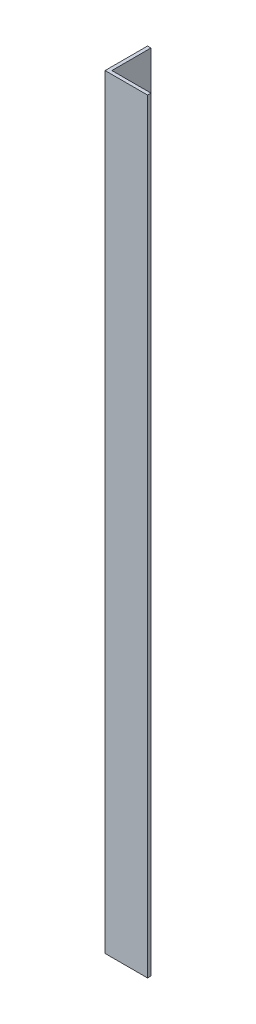
ISO-10303-21;
HEADER;
FILE_DESCRIPTION(('STEP AP214'),'2;1');
FILE_NAME('part.step','',(''),(''),'','','');
FILE_SCHEMA(('AUTOMOTIVE_DESIGN { 1 0 10303 214 1 1 1 1 }'));
ENDSEC;
DATA;
#1=APPLICATION_CONTEXT('core data for automotive mechanical design processes');
#2=APPLICATION_PROTOCOL_DEFINITION('international standard','automotive_design',2000,#1);
#3=PRODUCT_CONTEXT('',#1,'mechanical');
#4=PRODUCT('Part','Part','',(#3));
#5=PRODUCT_RELATED_PRODUCT_CATEGORY('part','',(#4));
#6=PRODUCT_DEFINITION_FORMATION('','',#4);
#7=PRODUCT_DEFINITION_CONTEXT('part definition',#1,'design');
#8=PRODUCT_DEFINITION('design','',#6,#7);
#9=PRODUCT_DEFINITION_SHAPE('','',#8);
#10=(LENGTH_UNIT() NAMED_UNIT(*) SI_UNIT(.MILLI.,.METRE.));
#11=(NAMED_UNIT(*) PLANE_ANGLE_UNIT() SI_UNIT($,.RADIAN.));
#12=(NAMED_UNIT(*) SI_UNIT($,.STERADIAN.) SOLID_ANGLE_UNIT());
#13=UNCERTAINTY_MEASURE_WITH_UNIT(LENGTH_MEASURE(1.E-05),#10,'distance_accuracy_value','');
#14=(GEOMETRIC_REPRESENTATION_CONTEXT(3) GLOBAL_UNCERTAINTY_ASSIGNED_CONTEXT((#13)) GLOBAL_UNIT_ASSIGNED_CONTEXT((#10,
#11,#12)) REPRESENTATION_CONTEXT('',''));
#15=CARTESIAN_POINT('',(0.,0.,0.));
#16=DIRECTION('',(0.,0.,1.));
#17=DIRECTION('',(1.,0.,0.));
#18=AXIS2_PLACEMENT_3D('',#15,#16,#17);
#19=CARTESIAN_POINT('',(0.,900.,0.));
#20=DIRECTION('',(0.,0.,-1.));
#21=DIRECTION('',(-1.,0.,0.));
#22=AXIS2_PLACEMENT_3D('',#19,#20,#21);
#23=PLANE('',#22);
#24=DIRECTION('',(1.,0.,0.));
#25=VECTOR('',#24,1.);
#26=CARTESIAN_POINT('',(0.,0.,0.));
#27=LINE('',#26,#25);
#28=CARTESIAN_POINT('',(0.,0.,0.));
#29=VERTEX_POINT('',#28);
#30=CARTESIAN_POINT('',(50.,0.,0.));
#31=VERTEX_POINT('',#30);
#32=EDGE_CURVE('E118',#29,#31,#27,.T.);
#33=ORIENTED_EDGE('',*,*,#32,.T.);
#34=DIRECTION('',(0.,-1.,0.));
#35=VECTOR('',#34,1.);
#36=CARTESIAN_POINT('',(50.,900.,0.));
#37=LINE('',#36,#35);
#38=CARTESIAN_POINT('',(50.,900.,0.));
#39=VERTEX_POINT('',#38);
#40=EDGE_CURVE('E11',#39,#31,#37,.T.);
#41=ORIENTED_EDGE('',*,*,#40,.F.);
#42=DIRECTION('',(1.,0.,0.));
#43=VECTOR('',#42,1.);
#44=CARTESIAN_POINT('',(0.,900.,0.));
#45=LINE('',#44,#43);
#46=CARTESIAN_POINT('',(0.,900.,0.));
#47=VERTEX_POINT('',#46);
#48=EDGE_CURVE('E83',#47,#39,#45,.T.);
#49=ORIENTED_EDGE('',*,*,#48,.F.);
#50=DIRECTION('',(0.,-1.,0.));
#51=VECTOR('',#50,1.);
#52=CARTESIAN_POINT('',(0.,900.,0.));
#53=LINE('',#52,#51);
#54=EDGE_CURVE('E114',#47,#29,#53,.T.);
#55=ORIENTED_EDGE('',*,*,#54,.T.);
#56=EDGE_LOOP('',(#33,#41,#49,#55));
#57=FACE_BOUND('',#56,.T.);
#58=ADVANCED_FACE('F37',(#57),#23,.F.);
#59=CARTESIAN_POINT('',(50.,900.,-4.));
#60=DIRECTION('',(1.,0.,0.));
#61=DIRECTION('',(0.,0.,-1.));
#62=AXIS2_PLACEMENT_3D('',#59,#60,#61);
#63=PLANE('',#62);
#64=DIRECTION('',(0.,0.,1.));
#65=VECTOR('',#64,1.);
#66=CARTESIAN_POINT('',(50.,0.,-4.));
#67=LINE('',#66,#65);
#68=CARTESIAN_POINT('',(50.,0.,-4.));
#69=VERTEX_POINT('',#68);
#70=EDGE_CURVE('E121',#69,#31,#67,.T.);
#71=ORIENTED_EDGE('',*,*,#70,.F.);
#72=DIRECTION('',(0.,-1.,0.));
#73=VECTOR('',#72,1.);
#74=CARTESIAN_POINT('',(50.,900.,-4.));
#75=LINE('',#74,#73);
#76=CARTESIAN_POINT('',(50.,900.,-4.));
#77=VERTEX_POINT('',#76);
#78=EDGE_CURVE('E45',#77,#69,#75,.T.);
#79=ORIENTED_EDGE('',*,*,#78,.F.);
#80=DIRECTION('',(0.,0.,1.));
#81=VECTOR('',#80,1.);
#82=CARTESIAN_POINT('',(50.,900.,-4.));
#83=LINE('',#82,#81);
#84=EDGE_CURVE('E223',#77,#39,#83,.T.);
#85=ORIENTED_EDGE('',*,*,#84,.T.);
#86=ORIENTED_EDGE('',*,*,#40,.T.);
#87=EDGE_LOOP('',(#71,#79,#85,#86));
#88=FACE_BOUND('',#87,.T.);
#89=ADVANCED_FACE('F139',(#88),#63,.T.);
#90=CARTESIAN_POINT('',(0.,900.,-4.));
#91=DIRECTION('',(0.,0.,-1.));
#92=DIRECTION('',(-1.,0.,0.));
#93=AXIS2_PLACEMENT_3D('',#90,#91,#92);
#94=PLANE('',#93);
#95=DIRECTION('',(1.,0.,0.));
#96=VECTOR('',#95,1.);
#97=CARTESIAN_POINT('',(0.,0.,-4.));
#98=LINE('',#97,#96);
#99=CARTESIAN_POINT('',(4.,0.,-4.));
#100=VERTEX_POINT('',#99);
#101=EDGE_CURVE('E124',#100,#69,#98,.T.);
#102=ORIENTED_EDGE('',*,*,#101,.F.);
#103=DIRECTION('',(0.,-1.,0.));
#104=VECTOR('',#103,1.);
#105=CARTESIAN_POINT('',(4.,900.,-4.));
#106=LINE('',#105,#104);
#107=CARTESIAN_POINT('',(4.,900.,-4.));
#108=VERTEX_POINT('',#107);
#109=EDGE_CURVE('E104',#108,#100,#106,.T.);
#110=ORIENTED_EDGE('',*,*,#109,.F.);
#111=DIRECTION('',(1.,0.,0.));
#112=VECTOR('',#111,1.);
#113=CARTESIAN_POINT('',(0.,900.,-4.));
#114=LINE('',#113,#112);
#115=EDGE_CURVE('E110',#108,#77,#114,.T.);
#116=ORIENTED_EDGE('',*,*,#115,.T.);
#117=ORIENTED_EDGE('',*,*,#78,.T.);
#118=EDGE_LOOP('',(#102,#110,#116,#117));
#119=FACE_BOUND('',#118,.T.);
#120=ADVANCED_FACE('F136',(#119),#94,.T.);
#121=CARTESIAN_POINT('',(4.,900.,-50.));
#122=DIRECTION('',(1.,0.,0.));
#123=DIRECTION('',(0.,0.,-1.));
#124=AXIS2_PLACEMENT_3D('',#121,#122,#123);
#125=PLANE('',#124);
#126=DIRECTION('',(0.,0.,1.));
#127=VECTOR('',#126,1.);
#128=CARTESIAN_POINT('',(4.,0.,-50.));
#129=LINE('',#128,#127);
#130=CARTESIAN_POINT('',(4.,0.,-50.));
#131=VERTEX_POINT('',#130);
#132=EDGE_CURVE('E99',#131,#100,#129,.T.);
#133=ORIENTED_EDGE('',*,*,#132,.F.);
#134=DIRECTION('',(0.,-1.,0.));
#135=VECTOR('',#134,1.);
#136=CARTESIAN_POINT('',(4.,900.,-50.));
#137=LINE('',#136,#135);
#138=CARTESIAN_POINT('',(4.,900.,-50.));
#139=VERTEX_POINT('',#138);
#140=EDGE_CURVE('E94',#139,#131,#137,.T.);
#141=ORIENTED_EDGE('',*,*,#140,.F.);
#142=DIRECTION('',(0.,0.,1.));
#143=VECTOR('',#142,1.);
#144=CARTESIAN_POINT('',(4.,900.,-50.));
#145=LINE('',#144,#143);
#146=EDGE_CURVE('E97',#139,#108,#145,.T.);
#147=ORIENTED_EDGE('',*,*,#146,.T.);
#148=ORIENTED_EDGE('',*,*,#109,.T.);
#149=EDGE_LOOP('',(#133,#141,#147,#148));
#150=FACE_BOUND('',#149,.T.);
#151=ADVANCED_FACE('F96',(#150),#125,.T.);
#152=CARTESIAN_POINT('',(0.,900.,-50.));
#153=DIRECTION('',(0.,0.,-1.));
#154=DIRECTION('',(-1.,0.,0.));
#155=AXIS2_PLACEMENT_3D('',#152,#153,#154);
#156=PLANE('',#155);
#157=DIRECTION('',(1.,0.,0.));
#158=VECTOR('',#157,1.);
#159=CARTESIAN_POINT('',(0.,0.,-50.));
#160=LINE('',#159,#158);
#161=CARTESIAN_POINT('',(0.,0.,-50.));
#162=VERTEX_POINT('',#161);
#163=EDGE_CURVE('E128',#162,#131,#160,.T.);
#164=ORIENTED_EDGE('',*,*,#163,.F.);
#165=DIRECTION('',(0.,-1.,0.));
#166=VECTOR('',#165,1.);
#167=CARTESIAN_POINT('',(0.,900.,-50.));
#168=LINE('',#167,#166);
#169=CARTESIAN_POINT('',(0.,900.,-50.));
#170=VERTEX_POINT('',#169);
#171=EDGE_CURVE('E74',#170,#162,#168,.T.);
#172=ORIENTED_EDGE('',*,*,#171,.F.);
#173=DIRECTION('',(1.,0.,0.));
#174=VECTOR('',#173,1.);
#175=CARTESIAN_POINT('',(0.,900.,-50.));
#176=LINE('',#175,#174);
#177=EDGE_CURVE('E108',#170,#139,#176,.T.);
#178=ORIENTED_EDGE('',*,*,#177,.T.);
#179=ORIENTED_EDGE('',*,*,#140,.T.);
#180=EDGE_LOOP('',(#164,#172,#178,#179));
#181=FACE_BOUND('',#180,.T.);
#182=ADVANCED_FACE('F112',(#181),#156,.T.);
#183=CARTESIAN_POINT('',(0.,900.,-50.));
#184=DIRECTION('',(1.,0.,0.));
#185=DIRECTION('',(0.,0.,-1.));
#186=AXIS2_PLACEMENT_3D('',#183,#184,#185);
#187=PLANE('',#186);
#188=DIRECTION('',(0.,0.,1.));
#189=VECTOR('',#188,1.);
#190=CARTESIAN_POINT('',(0.,0.,-50.));
#191=LINE('',#190,#189);
#192=EDGE_CURVE('E77',#162,#29,#191,.T.);
#193=ORIENTED_EDGE('',*,*,#192,.T.);
#194=ORIENTED_EDGE('',*,*,#54,.F.);
#195=DIRECTION('',(0.,0.,1.));
#196=VECTOR('',#195,1.);
#197=CARTESIAN_POINT('',(0.,900.,-50.));
#198=LINE('',#197,#196);
#199=EDGE_CURVE('E53',#170,#47,#198,.T.);
#200=ORIENTED_EDGE('',*,*,#199,.F.);
#201=ORIENTED_EDGE('',*,*,#171,.T.);
#202=EDGE_LOOP('',(#193,#194,#200,#201));
#203=FACE_BOUND('',#202,.T.);
#204=ADVANCED_FACE('F144',(#203),#187,.F.);
#205=CARTESIAN_POINT('',(0.,900.,0.));
#206=DIRECTION('',(0.,-1.,0.));
#207=DIRECTION('',(-1.,0.,0.));
#208=AXIS2_PLACEMENT_3D('',#205,#206,#207);
#209=PLANE('',#208);
#210=ORIENTED_EDGE('',*,*,#48,.T.);
#211=ORIENTED_EDGE('',*,*,#84,.F.);
#212=ORIENTED_EDGE('',*,*,#115,.F.);
#213=ORIENTED_EDGE('',*,*,#146,.F.);
#214=ORIENTED_EDGE('',*,*,#177,.F.);
#215=ORIENTED_EDGE('',*,*,#199,.T.);
#216=EDGE_LOOP('',(#210,#211,#212,#213,#214,#215));
#217=FACE_BOUND('',#216,.T.);
#218=ADVANCED_FACE('F107',(#217),#209,.F.);
#219=CARTESIAN_POINT('',(0.,0.,0.));
#220=DIRECTION('',(0.,-1.,0.));
#221=DIRECTION('',(-1.,0.,0.));
#222=AXIS2_PLACEMENT_3D('',#219,#220,#221);
#223=PLANE('',#222);
#224=ORIENTED_EDGE('',*,*,#32,.F.);
#225=ORIENTED_EDGE('',*,*,#192,.F.);
#226=ORIENTED_EDGE('',*,*,#163,.T.);
#227=ORIENTED_EDGE('',*,*,#132,.T.);
#228=ORIENTED_EDGE('',*,*,#101,.T.);
#229=ORIENTED_EDGE('',*,*,#70,.T.);
#230=EDGE_LOOP('',(#224,#225,#226,#227,#228,#229));
#231=FACE_BOUND('',#230,.T.);
#232=ADVANCED_FACE('F142',(#231),#223,.T.);
#233=CLOSED_SHELL('',(#58,#89,#120,#151,#182,#204,#218,#232));
#234=MANIFOLD_SOLID_BREP('B2',#233);
#235=ADVANCED_BREP_SHAPE_REPRESENTATION('',(#18,#234),#14);
#236=SHAPE_DEFINITION_REPRESENTATION(#9,#235);
ENDSEC;
END-ISO-10303-21;
